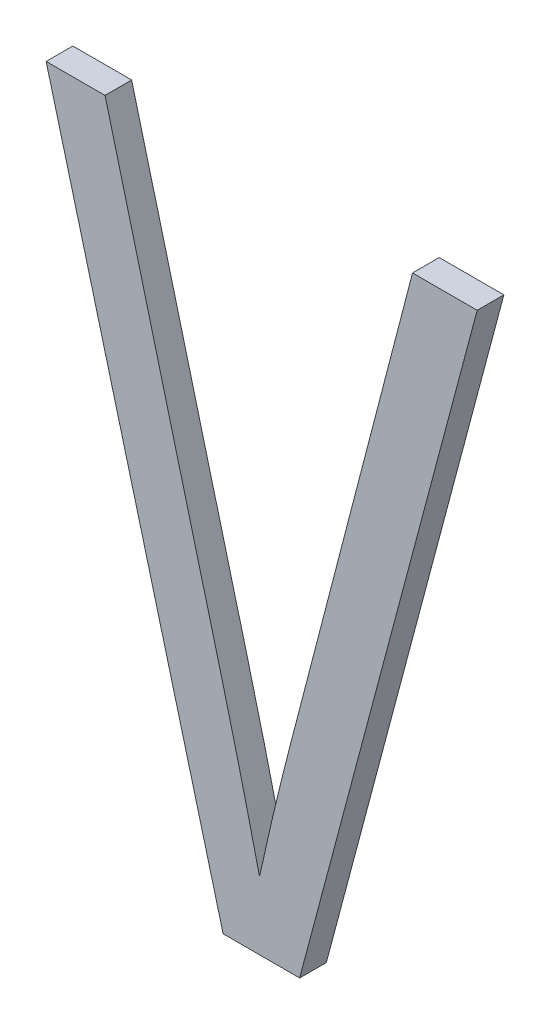
ISO-10303-21;
HEADER;
FILE_DESCRIPTION(('STEP AP214'),'2;1');
FILE_NAME('part.step','',(''),(''),'','','');
FILE_SCHEMA(('AUTOMOTIVE_DESIGN { 1 0 10303 214 1 1 1 1 }'));
ENDSEC;
DATA;
#1=APPLICATION_CONTEXT('core data for automotive mechanical design processes');
#2=APPLICATION_PROTOCOL_DEFINITION('international standard','automotive_design',2000,#1);
#3=PRODUCT_CONTEXT('',#1,'mechanical');
#4=PRODUCT('Part','Part','',(#3));
#5=PRODUCT_RELATED_PRODUCT_CATEGORY('part','',(#4));
#6=PRODUCT_DEFINITION_FORMATION('','',#4);
#7=PRODUCT_DEFINITION_CONTEXT('part definition',#1,'design');
#8=PRODUCT_DEFINITION('design','',#6,#7);
#9=PRODUCT_DEFINITION_SHAPE('','',#8);
#10=(LENGTH_UNIT() NAMED_UNIT(*) SI_UNIT(.MILLI.,.METRE.));
#11=(NAMED_UNIT(*) PLANE_ANGLE_UNIT() SI_UNIT($,.RADIAN.));
#12=(NAMED_UNIT(*) SI_UNIT($,.STERADIAN.) SOLID_ANGLE_UNIT());
#13=UNCERTAINTY_MEASURE_WITH_UNIT(LENGTH_MEASURE(1.E-05),#10,'distance_accuracy_value','');
#14=(GEOMETRIC_REPRESENTATION_CONTEXT(3) GLOBAL_UNCERTAINTY_ASSIGNED_CONTEXT((#13)) GLOBAL_UNIT_ASSIGNED_CONTEXT((#10,
#11,#12)) REPRESENTATION_CONTEXT('',''));
#15=CARTESIAN_POINT('',(0.,0.,0.));
#16=DIRECTION('',(0.,0.,1.));
#17=DIRECTION('',(1.,0.,0.));
#18=AXIS2_PLACEMENT_3D('',#15,#16,#17);
#19=CARTESIAN_POINT('',(181.239678023788,126.250750795798,-39.));
#20=DIRECTION('',(0.,0.,-1.));
#21=DIRECTION('',(-1.,0.,0.));
#22=AXIS2_PLACEMENT_3D('',#19,#20,#21);
#23=PLANE('',#22);
#24=DIRECTION('',(0.25720713796838,0.966356294633669,0.));
#25=VECTOR('',#24,1.);
#26=CARTESIAN_POINT('',(181.119291191569,124.913993413852,-39.));
#27=LINE('',#26,#25);
#28=CARTESIAN_POINT('',(181.784695710059,127.413993413853,-39.));
#29=VERTEX_POINT('',#28);
#30=CARTESIAN_POINT('',(181.119291191569,124.913993413852,-39.));
#31=VERTEX_POINT('',#30);
#32=EDGE_CURVE('E134',#29,#31,#27,.F.);
#33=ORIENTED_EDGE('',*,*,#32,.F.);
#34=DIRECTION('',(1.,0.,0.));
#35=VECTOR('',#34,1.);
#36=CARTESIAN_POINT('',(181.784695710059,127.413993413853,-39.));
#37=LINE('',#36,#35);
#38=CARTESIAN_POINT('',(181.54236326023,127.413993413853,-39.));
#39=VERTEX_POINT('',#38);
#40=EDGE_CURVE('E86',#39,#29,#37,.T.);
#41=ORIENTED_EDGE('',*,*,#40,.F.);
#42=CARTESIAN_POINT('',(180.968843128966,125.168096113694,-39.));
#43=CARTESIAN_POINT('',(180.975856245563,125.200687304776,-39.));
#44=CARTESIAN_POINT('',(180.983040609489,125.233241086167,-39.));
#45=CARTESIAN_POINT('',(180.99771155575,125.298277512639,-39.));
#46=CARTESIAN_POINT('',(181.005198111272,125.330760163763,-39.));
#47=CARTESIAN_POINT('',(181.028053891351,125.428121198184,-39.));
#48=CARTESIAN_POINT('',(181.043818003835,125.492907032929,-39.));
#49=CARTESIAN_POINT('',(181.0681008593,125.58992729194,-39.));
#50=CARTESIAN_POINT('',(181.076301537983,125.622242018744,-39.));
#51=CARTESIAN_POINT('',(181.092913009021,125.686817562954,-39.));
#52=CARTESIAN_POINT('',(181.101323802716,125.719078380016,-39.));
#53=CARTESIAN_POINT('',(181.12653685941,125.815873630819,-39.));
#54=CARTESIAN_POINT('',(181.14331786256,125.880413460403,-39.));
#55=CARTESIAN_POINT('',(181.176894735474,126.009487627638,-39.));
#56=CARTESIAN_POINT('',(181.193690604855,126.074021965385,-39.));
#57=CARTESIAN_POINT('',(181.224313824543,126.191701412499,-39.));
#58=CARTESIAN_POINT('',(181.238141891703,126.244846339926,-39.));
#59=CARTESIAN_POINT('',(181.265798903161,126.351136324273,-39.));
#60=CARTESIAN_POINT('',(181.279627847464,126.404281381192,-39.));
#61=CARTESIAN_POINT('',(181.321112565564,126.5637093087,-39.));
#62=CARTESIAN_POINT('',(181.34876812361,126.669992234049,-39.));
#63=CARTESIAN_POINT('',(181.404079383542,126.882558048238,-39.));
#64=CARTESIAN_POINT('',(181.431735085429,126.988840937079,-39.));
#65=CARTESIAN_POINT('',(181.487048302264,127.201413682478,-39.));
#66=CARTESIAN_POINT('',(181.514705817212,127.307703539037,-39.));
#67=CARTESIAN_POINT('',(181.54236326023,127.413993413853,-39.));
#68=B_SPLINE_CURVE_WITH_KNOTS('',3,(#42,#43,#44,#45,#46,#47,#48,#49,#50,#51,#52,#53,#54,#55,#56,
#57,#58,#59,#60,#61,#62,#63,#64,#65,#66,#67),.UNSPECIFIED.,.F.,.F.,(4,2,2,2,2,2,2,2,2,2,2,2,4),
(0.,0.100010304962381,0.200011755792453,0.40003193956738,0.500048584452223,0.600065867646368,
0.800123391583055,1.00017591771906,1.16491933234159,1.32966377086398,1.65913002478235,
1.98859627870073,2.31808413184568),.UNSPECIFIED.);
#69=CARTESIAN_POINT('',(180.968843128966,125.168096113694,-39.));
#70=VERTEX_POINT('',#69);
#71=EDGE_CURVE('E85',#70,#39,#68,.T.);
#72=ORIENTED_EDGE('',*,*,#71,.F.);
#73=CARTESIAN_POINT('',(180.389769545727,127.413993413853,-39.));
#74=CARTESIAN_POINT('',(180.40665044545,127.349499381872,-39.));
#75=CARTESIAN_POINT('',(180.423519108862,127.285002151439,-39.));
#76=CARTESIAN_POINT('',(180.474100993575,127.091504410396,-39.));
#77=CARTESIAN_POINT('',(180.507790170975,126.9624976148,-39.));
#78=CARTESIAN_POINT('',(180.575172077125,126.704484448967,-39.));
#79=CARTESIAN_POINT('',(180.608864805888,126.575478078734,-39.));
#80=CARTESIAN_POINT('',(180.656500667773,126.393296499986,-39.));
#81=CARTESIAN_POINT('',(180.670413373398,126.340113337258,-39.));
#82=CARTESIAN_POINT('',(180.698254170609,126.233751132263,-39.));
#83=CARTESIAN_POINT('',(180.71218226217,126.180572089989,-39.));
#84=CARTESIAN_POINT('',(180.740065954398,126.074222230052,-39.));
#85=CARTESIAN_POINT('',(180.754021554574,126.021051412259,-39.));
#86=CARTESIAN_POINT('',(180.781936833412,125.91471054654,-39.));
#87=CARTESIAN_POINT('',(180.795896512096,125.861540498619,-39.));
#88=CARTESIAN_POINT('',(180.816923136726,125.781805571366,-39.));
#89=CARTESIAN_POINT('',(180.823946874559,125.755229322144,-39.));
#90=CARTESIAN_POINT('',(180.837880717207,125.702047130188,-39.));
#91=CARTESIAN_POINT('',(180.84479082283,125.675441187667,-39.));
#92=CARTESIAN_POINT('',(180.865292345025,125.595565315924,-39.));
#93=CARTESIAN_POINT('',(180.878655138376,125.542236704935,-39.));
#94=CARTESIAN_POINT('',(180.904989356478,125.435480857184,-39.));
#95=CARTESIAN_POINT('',(180.917960761872,125.382053615682,-39.));
#96=CARTESIAN_POINT('',(180.943603923358,125.275124326045,-39.));
#97=CARTESIAN_POINT('',(180.956275664285,125.221622274268,-39.));
#98=CARTESIAN_POINT('',(180.968843128966,125.168096113694,-39.));
#99=B_SPLINE_CURVE_WITH_KNOTS('',3,(#73,#74,#75,#76,#77,#78,#79,#80,#81,#82,#83,#84,#85,#86,#87,
#88,#89,#90,#91,#92,#93,#94,#95,#96,#97,#98),.UNSPECIFIED.,.F.,.F.,(4,2,2,2,2,2,2,2,2,2,2,2,4),
(0.,0.200000002834143,0.599999278956295,1.00000001146499,1.16491850408225,1.32983671968778,
1.49475201042103,1.65966814115244,1.7421342627194,1.82459979749078,1.98952888645083,
2.15446611966161,2.31941168226652),.UNSPECIFIED.);
#100=CARTESIAN_POINT('',(180.389769545727,127.413993413853,-39.));
#101=VERTEX_POINT('',#100);
#102=EDGE_CURVE('E24',#101,#70,#99,.T.);
#103=ORIENTED_EDGE('',*,*,#102,.F.);
#104=DIRECTION('',(1.,0.,0.));
#105=VECTOR('',#104,1.);
#106=CARTESIAN_POINT('',(180.389769545727,127.413993413853,-39.));
#107=LINE('',#106,#105);
#108=CARTESIAN_POINT('',(180.169146044528,127.413993413853,-39.));
#109=VERTEX_POINT('',#108);
#110=EDGE_CURVE('E111',#109,#101,#107,.T.);
#111=ORIENTED_EDGE('',*,*,#110,.F.);
#112=DIRECTION('',(0.256477961167415,-0.966550079114065,0.));
#113=VECTOR('',#112,1.);
#114=CARTESIAN_POINT('',(180.169146044528,127.413993413853,-39.));
#115=LINE('',#114,#113);
#116=CARTESIAN_POINT('',(180.832531125937,124.913993413853,-39.));
#117=VERTEX_POINT('',#116);
#118=EDGE_CURVE('E124',#117,#109,#115,.F.);
#119=ORIENTED_EDGE('',*,*,#118,.F.);
#120=DIRECTION('',(1.,0.,0.));
#121=VECTOR('',#120,1.);
#122=CARTESIAN_POINT('',(180.832531125937,124.913993413852,-39.));
#123=LINE('',#122,#121);
#124=EDGE_CURVE('E143',#31,#117,#123,.F.);
#125=ORIENTED_EDGE('',*,*,#124,.F.);
#126=EDGE_LOOP('',(#33,#41,#72,#103,#111,#119,#125));
#127=FACE_BOUND('',#126,.T.);
#128=ADVANCED_FACE('F17',(#127),#23,.F.);
#129=CARTESIAN_POINT('',(180.832531125937,124.913993413852,-39.1));
#130=DIRECTION('',(0.,-1.,0.));
#131=DIRECTION('',(0.,0.,-1.));
#132=AXIS2_PLACEMENT_3D('',#129,#130,#131);
#133=PLANE('',#132);
#134=DIRECTION('',(-1.,0.,0.));
#135=VECTOR('',#134,1.);
#136=CARTESIAN_POINT('',(181.239678023788,124.913993413852,-39.1));
#137=LINE('',#136,#135);
#138=CARTESIAN_POINT('',(181.119291191569,124.913993413852,-39.1));
#139=VERTEX_POINT('',#138);
#140=CARTESIAN_POINT('',(180.832531125937,124.913993413853,-39.1));
#141=VERTEX_POINT('',#140);
#142=EDGE_CURVE('E118',#139,#141,#137,.T.);
#143=ORIENTED_EDGE('',*,*,#142,.F.);
#144=DIRECTION('',(0.,0.,1.));
#145=VECTOR('',#144,1.);
#146=CARTESIAN_POINT('',(181.119291191569,124.913993413852,-39.1));
#147=LINE('',#146,#145);
#148=EDGE_CURVE('E131',#31,#139,#147,.F.);
#149=ORIENTED_EDGE('',*,*,#148,.F.);
#150=ORIENTED_EDGE('',*,*,#124,.T.);
#151=DIRECTION('',(0.,0.,1.));
#152=VECTOR('',#151,1.);
#153=CARTESIAN_POINT('',(180.832531125937,124.913993413853,-39.1));
#154=LINE('',#153,#152);
#155=EDGE_CURVE('E121',#141,#117,#154,.T.);
#156=ORIENTED_EDGE('',*,*,#155,.F.);
#157=EDGE_LOOP('',(#143,#149,#150,#156));
#158=FACE_BOUND('',#157,.T.);
#159=ADVANCED_FACE('F186',(#158),#133,.T.);
#160=CARTESIAN_POINT('',(180.169146044528,127.413993413853,-39.1));
#161=DIRECTION('',(-0.966550079114065,-0.256477961167415,0.));
#162=DIRECTION('',(0.256477961167415,-0.966550079114065,0.));
#163=AXIS2_PLACEMENT_3D('',#160,#161,#162);
#164=PLANE('',#163);
#165=DIRECTION('',(-0.256477961167383,0.966550079114074,0.));
#166=VECTOR('',#165,1.);
#167=CARTESIAN_POINT('',(180.832531125937,124.913993413852,-39.1));
#168=LINE('',#167,#166);
#169=CARTESIAN_POINT('',(180.169146044528,127.413993413853,-39.1));
#170=VERTEX_POINT('',#169);
#171=EDGE_CURVE('E114',#141,#170,#168,.T.);
#172=ORIENTED_EDGE('',*,*,#171,.F.);
#173=ORIENTED_EDGE('',*,*,#155,.T.);
#174=ORIENTED_EDGE('',*,*,#118,.T.);
#175=DIRECTION('',(0.,0.,1.));
#176=VECTOR('',#175,1.);
#177=CARTESIAN_POINT('',(180.169146044528,127.413993413853,-39.1));
#178=LINE('',#177,#176);
#179=EDGE_CURVE('E97',#170,#109,#178,.T.);
#180=ORIENTED_EDGE('',*,*,#179,.F.);
#181=EDGE_LOOP('',(#172,#173,#174,#180));
#182=FACE_BOUND('',#181,.T.);
#183=ADVANCED_FACE('F182',(#182),#164,.T.);
#184=CARTESIAN_POINT('',(180.389769545727,127.413993413853,-39.1));
#185=DIRECTION('',(0.,1.,0.));
#186=DIRECTION('',(0.,0.,1.));
#187=AXIS2_PLACEMENT_3D('',#184,#185,#186);
#188=PLANE('',#187);
#189=DIRECTION('',(-1.,0.,0.));
#190=VECTOR('',#189,1.);
#191=CARTESIAN_POINT('',(181.239678023788,127.413993413853,-39.1));
#192=LINE('',#191,#190);
#193=CARTESIAN_POINT('',(180.389769545727,127.413993413853,-39.1));
#194=VERTEX_POINT('',#193);
#195=EDGE_CURVE('E117',#170,#194,#192,.F.);
#196=ORIENTED_EDGE('',*,*,#195,.F.);
#197=ORIENTED_EDGE('',*,*,#179,.T.);
#198=ORIENTED_EDGE('',*,*,#110,.T.);
#199=DIRECTION('',(0.,0.,1.));
#200=VECTOR('',#199,1.);
#201=CARTESIAN_POINT('',(180.389769545727,127.413993413853,-39.05));
#202=LINE('',#201,#200);
#203=EDGE_CURVE('E91',#194,#101,#202,.T.);
#204=ORIENTED_EDGE('',*,*,#203,.F.);
#205=EDGE_LOOP('',(#196,#197,#198,#204));
#206=FACE_BOUND('',#205,.T.);
#207=ADVANCED_FACE('F179',(#206),#188,.T.);
#208=CARTESIAN_POINT('',(180.968843128966,125.168096113694,-39.1));
#209=CARTESIAN_POINT('',(180.968843128966,125.168096113694,-39.));
#210=CARTESIAN_POINT('',(180.918357201918,125.383156992466,-39.1));
#211=CARTESIAN_POINT('',(180.918357201918,125.383156992466,-39.));
#212=CARTESIAN_POINT('',(180.871910149034,125.573072291565,-39.1));
#213=CARTESIAN_POINT('',(180.871910149034,125.573072291565,-39.));
#214=CARTESIAN_POINT('',(180.681330372426,126.296317273503,-39.1));
#215=CARTESIAN_POINT('',(180.681330372426,126.296317273503,-39.));
#216=CARTESIAN_POINT('',(180.536010447743,126.855276279566,-39.1));
#217=CARTESIAN_POINT('',(180.536010447743,126.855276279566,-39.));
#218=CARTESIAN_POINT('',(180.389769545727,127.413993413853,-39.1));
#219=CARTESIAN_POINT('',(180.389769545727,127.413993413853,-39.));
#220=B_SPLINE_SURFACE_WITH_KNOTS('',3,1,((#208,#209),(#210,#211),(#212,#213),(#214,#215),(#216,
#217),(#218,#219)),.UNSPECIFIED.,.F.,.F.,.F.,(4,2,4),(2,2),(0.,0.22782006587442,1.),(1.,1.1),.UNSPECIFIED.);
#221=CARTESIAN_POINT('',(180.389769545727,127.413993413853,-39.1));
#222=CARTESIAN_POINT('',(180.40665044545,127.349499381872,-39.1));
#223=CARTESIAN_POINT('',(180.423519108862,127.285002151439,-39.1));
#224=CARTESIAN_POINT('',(180.474100993576,127.091504410396,-39.1));
#225=CARTESIAN_POINT('',(180.507790170975,126.9624976148,-39.1));
#226=CARTESIAN_POINT('',(180.575172077125,126.704484448967,-39.1));
#227=CARTESIAN_POINT('',(180.608864805888,126.575478078734,-39.1));
#228=CARTESIAN_POINT('',(180.656500667773,126.393296499986,-39.1));
#229=CARTESIAN_POINT('',(180.670413373398,126.340113337258,-39.1));
#230=CARTESIAN_POINT('',(180.698254170609,126.233751132263,-39.1));
#231=CARTESIAN_POINT('',(180.71218226217,126.180572089989,-39.1));
#232=CARTESIAN_POINT('',(180.740065954398,126.074222230052,-39.1));
#233=CARTESIAN_POINT('',(180.754021554574,126.021051412259,-39.1));
#234=CARTESIAN_POINT('',(180.781936833412,125.91471054654,-39.1));
#235=CARTESIAN_POINT('',(180.795896512096,125.861540498619,-39.1));
#236=CARTESIAN_POINT('',(180.816923136726,125.781805571366,-39.1));
#237=CARTESIAN_POINT('',(180.823946874559,125.755229322144,-39.1));
#238=CARTESIAN_POINT('',(180.837880717207,125.702047130188,-39.1));
#239=CARTESIAN_POINT('',(180.84479082283,125.675441187667,-39.1));
#240=CARTESIAN_POINT('',(180.865292345025,125.595565315924,-39.1));
#241=CARTESIAN_POINT('',(180.878655138376,125.542236704935,-39.1));
#242=CARTESIAN_POINT('',(180.904989356478,125.435480857184,-39.1));
#243=CARTESIAN_POINT('',(180.917960761872,125.382053615682,-39.1));
#244=CARTESIAN_POINT('',(180.943603923358,125.275124326045,-39.1));
#245=CARTESIAN_POINT('',(180.956275664285,125.221622274268,-39.1));
#246=CARTESIAN_POINT('',(180.968843128966,125.168096113694,-39.1));
#247=B_SPLINE_CURVE_WITH_KNOTS('',3,(#221,#222,#223,#224,#225,#226,#227,#228,#229,#230,#231,
#232,#233,#234,#235,#236,#237,#238,#239,#240,#241,#242,#243,#244,#245,#246),.UNSPECIFIED.,.F.,
.F.,(4,2,2,2,2,2,2,2,2,2,2,2,4),(0.,0.200000002834143,0.599999278956303,1.00000001146499,
1.16491850408222,1.32983671968775,1.494752010421,1.65966814115242,1.74213426271937,
1.82459979749078,1.9895288864508,2.15446611966161,2.31941168226652),.UNSPECIFIED.);
#248=CARTESIAN_POINT('',(180.968843128966,125.168096113694,-39.1));
#249=VERTEX_POINT('',#248);
#250=EDGE_CURVE('E161',#194,#249,#247,.T.);
#251=DIRECTION('',(0.,0.,1.));
#252=VECTOR('',#251,1.);
#253=CARTESIAN_POINT('',(180.968843128966,125.168096113694,-39.05));
#254=LINE('',#253,#252);
#255=EDGE_CURVE('E90',#249,#70,#254,.T.);
#256=ORIENTED_EDGE('',*,*,#250,.F.);
#257=ORIENTED_EDGE('',*,*,#203,.T.);
#258=ORIENTED_EDGE('',*,*,#102,.T.);
#259=ORIENTED_EDGE('',*,*,#255,.F.);
#260=EDGE_LOOP('',(#256,#257,#258,#259));
#261=FACE_BOUND('',#260,.T.);
#262=ADVANCED_FACE('F95',(#261),#220,.T.);
#263=CARTESIAN_POINT('',(181.54236326023,127.413993413853,-39.1));
#264=CARTESIAN_POINT('',(181.54236326023,127.413993413853,-39.));
#265=CARTESIAN_POINT('',(181.393766348285,126.842924064991,-39.1));
#266=CARTESIAN_POINT('',(181.393766348285,126.842924064991,-39.));
#267=CARTESIAN_POINT('',(181.245169436341,126.271854716129,-39.1));
#268=CARTESIAN_POINT('',(181.245169436341,126.271854716129,-39.));
#269=CARTESIAN_POINT('',(181.043379278714,125.496359637426,-39.1));
#270=CARTESIAN_POINT('',(181.043379278714,125.496359637426,-39.));
#271=CARTESIAN_POINT('',(181.001154122277,125.318307865943,-39.1));
#272=CARTESIAN_POINT('',(181.001154122277,125.318307865943,-39.));
#273=CARTESIAN_POINT('',(180.968843128966,125.168096113694,-39.1));
#274=CARTESIAN_POINT('',(180.968843128966,125.168096113694,-39.));
#275=B_SPLINE_SURFACE_WITH_KNOTS('',3,1,((#263,#264),(#265,#266),(#267,#268),(#269,#270),(#271,
#272),(#273,#274)),.UNSPECIFIED.,.F.,.F.,.F.,(4,2,4),(2,2),(0.,0.736393259666835,1.),(1.,1.1),.UNSPECIFIED.);
#276=CARTESIAN_POINT('',(180.968843128966,125.168096113694,-39.1));
#277=CARTESIAN_POINT('',(180.975856245563,125.200687304776,-39.1));
#278=CARTESIAN_POINT('',(180.983040609489,125.233241086167,-39.1));
#279=CARTESIAN_POINT('',(180.99771155575,125.298277512639,-39.1));
#280=CARTESIAN_POINT('',(181.005198111272,125.330760163763,-39.1));
#281=CARTESIAN_POINT('',(181.028053891351,125.428121198184,-39.1));
#282=CARTESIAN_POINT('',(181.043818003835,125.492907032929,-39.1));
#283=CARTESIAN_POINT('',(181.0681008593,125.58992729194,-39.1));
#284=CARTESIAN_POINT('',(181.076301537983,125.622242018744,-39.1));
#285=CARTESIAN_POINT('',(181.092913009021,125.686817562954,-39.1));
#286=CARTESIAN_POINT('',(181.101323802716,125.719078380016,-39.1));
#287=CARTESIAN_POINT('',(181.12653685941,125.815873630819,-39.1));
#288=CARTESIAN_POINT('',(181.14331786256,125.880413460403,-39.1));
#289=CARTESIAN_POINT('',(181.176894735474,126.009487627638,-39.1));
#290=CARTESIAN_POINT('',(181.193690604855,126.074021965385,-39.1));
#291=CARTESIAN_POINT('',(181.224313824543,126.191701412499,-39.1));
#292=CARTESIAN_POINT('',(181.238141891703,126.244846339926,-39.1));
#293=CARTESIAN_POINT('',(181.265798903161,126.351136324273,-39.1));
#294=CARTESIAN_POINT('',(181.279627847464,126.404281381192,-39.1));
#295=CARTESIAN_POINT('',(181.321112565564,126.5637093087,-39.1));
#296=CARTESIAN_POINT('',(181.34876812361,126.669992234049,-39.1));
#297=CARTESIAN_POINT('',(181.404079383542,126.882558048238,-39.1));
#298=CARTESIAN_POINT('',(181.431735085429,126.988840937079,-39.1));
#299=CARTESIAN_POINT('',(181.487048302264,127.201413682478,-39.1));
#300=CARTESIAN_POINT('',(181.514705817212,127.307703539037,-39.1));
#301=CARTESIAN_POINT('',(181.54236326023,127.413993413853,-39.1));
#302=B_SPLINE_CURVE_WITH_KNOTS('',3,(#276,#277,#278,#279,#280,#281,#282,#283,#284,#285,#286,
#287,#288,#289,#290,#291,#292,#293,#294,#295,#296,#297,#298,#299,#300,#301),.UNSPECIFIED.,.F.,
.F.,(4,2,2,2,2,2,2,2,2,2,2,2,4),(0.,0.100010304962402,0.200011755792454,0.400031939567414,
0.500048584452224,0.600065867646388,0.800123391583075,1.00017591771906,1.16491933234159,
1.32966377086398,1.65913002478237,1.98859627870073,2.31808413184568),.UNSPECIFIED.);
#303=CARTESIAN_POINT('',(181.54236326023,127.413993413853,-39.1));
#304=VERTEX_POINT('',#303);
#305=EDGE_CURVE('E99',#249,#304,#302,.T.);
#306=DIRECTION('',(0.,0.,1.));
#307=VECTOR('',#306,1.);
#308=CARTESIAN_POINT('',(181.54236326023,127.413993413853,-39.1));
#309=LINE('',#308,#307);
#310=EDGE_CURVE('E102',#304,#39,#309,.T.);
#311=ORIENTED_EDGE('',*,*,#305,.F.);
#312=ORIENTED_EDGE('',*,*,#255,.T.);
#313=ORIENTED_EDGE('',*,*,#71,.T.);
#314=ORIENTED_EDGE('',*,*,#310,.F.);
#315=EDGE_LOOP('',(#311,#312,#313,#314));
#316=FACE_BOUND('',#315,.T.);
#317=ADVANCED_FACE('F19',(#316),#275,.T.);
#318=CARTESIAN_POINT('',(181.784695710059,127.413993413853,-39.1));
#319=DIRECTION('',(0.,1.,0.));
#320=DIRECTION('',(0.,0.,1.));
#321=AXIS2_PLACEMENT_3D('',#318,#319,#320);
#322=PLANE('',#321);
#323=DIRECTION('',(-1.,0.,0.));
#324=VECTOR('',#323,1.);
#325=CARTESIAN_POINT('',(181.239678023788,127.413993413853,-39.1));
#326=LINE('',#325,#324);
#327=CARTESIAN_POINT('',(181.784695710059,127.413993413853,-39.1));
#328=VERTEX_POINT('',#327);
#329=EDGE_CURVE('E35',#304,#328,#326,.F.);
#330=ORIENTED_EDGE('',*,*,#329,.F.);
#331=ORIENTED_EDGE('',*,*,#310,.T.);
#332=ORIENTED_EDGE('',*,*,#40,.T.);
#333=DIRECTION('',(0.,0.,1.));
#334=VECTOR('',#333,1.);
#335=CARTESIAN_POINT('',(181.784695710059,127.413993413853,-39.1));
#336=LINE('',#335,#334);
#337=EDGE_CURVE('E44',#328,#29,#336,.T.);
#338=ORIENTED_EDGE('',*,*,#337,.F.);
#339=EDGE_LOOP('',(#330,#331,#332,#338));
#340=FACE_BOUND('',#339,.T.);
#341=ADVANCED_FACE('F175',(#340),#322,.T.);
#342=CARTESIAN_POINT('',(181.119291191569,124.913993413852,-39.1));
#343=DIRECTION('',(0.966356294633669,-0.25720713796838,0.));
#344=DIRECTION('',(0.25720713796838,0.966356294633669,0.));
#345=AXIS2_PLACEMENT_3D('',#342,#343,#344);
#346=PLANE('',#345);
#347=DIRECTION('',(-0.257207137968393,-0.966356294633666,0.));
#348=VECTOR('',#347,1.);
#349=CARTESIAN_POINT('',(181.784695710059,127.413993413853,-39.1));
#350=LINE('',#349,#348);
#351=EDGE_CURVE('E11',#328,#139,#350,.T.);
#352=ORIENTED_EDGE('',*,*,#351,.F.);
#353=ORIENTED_EDGE('',*,*,#337,.T.);
#354=ORIENTED_EDGE('',*,*,#32,.T.);
#355=ORIENTED_EDGE('',*,*,#148,.T.);
#356=EDGE_LOOP('',(#352,#353,#354,#355));
#357=FACE_BOUND('',#356,.T.);
#358=ADVANCED_FACE('F170',(#357),#346,.T.);
#359=CARTESIAN_POINT('',(181.239678023788,126.250750795798,-39.1));
#360=DIRECTION('',(0.,0.,-1.));
#361=DIRECTION('',(-1.,0.,0.));
#362=AXIS2_PLACEMENT_3D('',#359,#360,#361);
#363=PLANE('',#362);
#364=ORIENTED_EDGE('',*,*,#329,.T.);
#365=ORIENTED_EDGE('',*,*,#351,.T.);
#366=ORIENTED_EDGE('',*,*,#142,.T.);
#367=ORIENTED_EDGE('',*,*,#171,.T.);
#368=ORIENTED_EDGE('',*,*,#195,.T.);
#369=ORIENTED_EDGE('',*,*,#250,.T.);
#370=ORIENTED_EDGE('',*,*,#305,.T.);
#371=EDGE_LOOP('',(#364,#365,#366,#367,#368,#369,#370));
#372=FACE_BOUND('',#371,.T.);
#373=ADVANCED_FACE('F166',(#372),#363,.T.);
#374=CLOSED_SHELL('',(#128,#159,#183,#207,#262,#317,#341,#358,#373));
#375=MANIFOLD_SOLID_BREP('B1',#374);
#376=ADVANCED_BREP_SHAPE_REPRESENTATION('',(#18,#375),#14);
#377=SHAPE_DEFINITION_REPRESENTATION(#9,#376);
ENDSEC;
END-ISO-10303-21;
